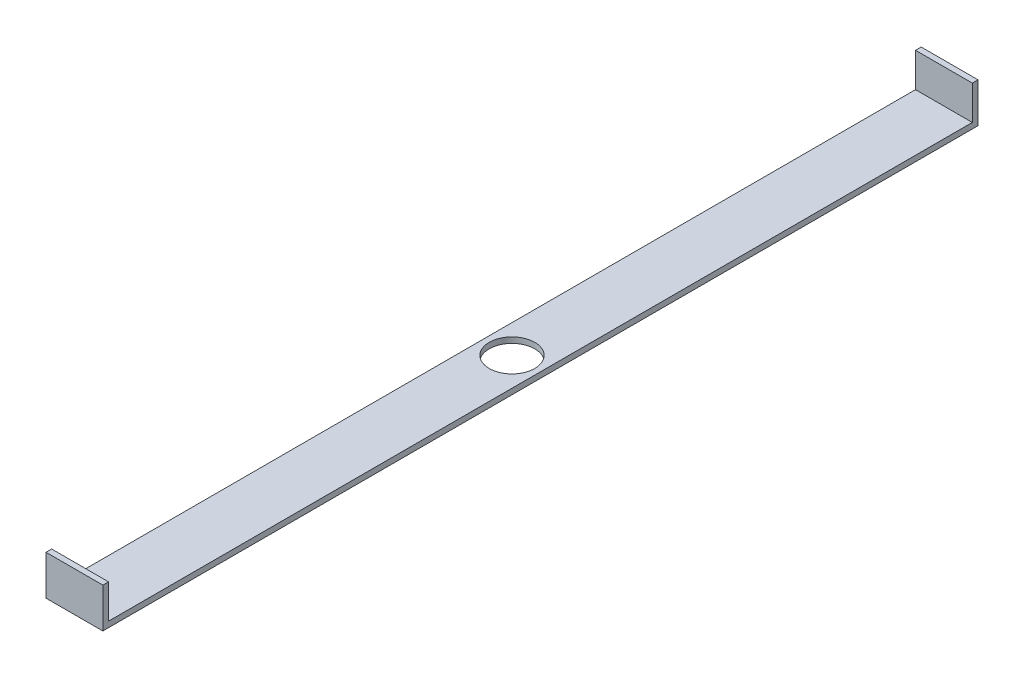
ISO-10303-21;
HEADER;
FILE_DESCRIPTION(('STEP AP214'),'2;1');
FILE_NAME('part.step','',(''),(''),'','','');
FILE_SCHEMA(('AUTOMOTIVE_DESIGN { 1 0 10303 214 1 1 1 1 }'));
ENDSEC;
DATA;
#1=APPLICATION_CONTEXT('core data for automotive mechanical design processes');
#2=APPLICATION_PROTOCOL_DEFINITION('international standard','automotive_design',2000,#1);
#3=PRODUCT_CONTEXT('',#1,'mechanical');
#4=PRODUCT('Part','Part','',(#3));
#5=PRODUCT_RELATED_PRODUCT_CATEGORY('part','',(#4));
#6=PRODUCT_DEFINITION_FORMATION('','',#4);
#7=PRODUCT_DEFINITION_CONTEXT('part definition',#1,'design');
#8=PRODUCT_DEFINITION('design','',#6,#7);
#9=PRODUCT_DEFINITION_SHAPE('','',#8);
#10=(LENGTH_UNIT() NAMED_UNIT(*) SI_UNIT(.MILLI.,.METRE.));
#11=(NAMED_UNIT(*) PLANE_ANGLE_UNIT() SI_UNIT($,.RADIAN.));
#12=(NAMED_UNIT(*) SI_UNIT($,.STERADIAN.) SOLID_ANGLE_UNIT());
#13=UNCERTAINTY_MEASURE_WITH_UNIT(LENGTH_MEASURE(1.E-05),#10,'distance_accuracy_value','');
#14=(GEOMETRIC_REPRESENTATION_CONTEXT(3) GLOBAL_UNCERTAINTY_ASSIGNED_CONTEXT((#13)) GLOBAL_UNIT_ASSIGNED_CONTEXT((#10,
#11,#12)) REPRESENTATION_CONTEXT('',''));
#15=CARTESIAN_POINT('',(0.,0.,0.));
#16=DIRECTION('',(0.,0.,1.));
#17=DIRECTION('',(1.,0.,0.));
#18=AXIS2_PLACEMENT_3D('',#15,#16,#17);
#19=CARTESIAN_POINT('',(0.,0.,770.));
#20=DIRECTION('',(0.,-1.,0.));
#21=DIRECTION('',(0.,0.,-1.));
#22=AXIS2_PLACEMENT_3D('',#19,#20,#21);
#23=PLANE('',#22);
#24=CARTESIAN_POINT('',(25.,0.,385.));
#25=DIRECTION('',(0.,1.,0.));
#26=DIRECTION('',(0.,0.,1.));
#27=AXIS2_PLACEMENT_3D('',#24,#25,#26);
#28=CIRCLE('',#27,20.);
#29=CARTESIAN_POINT('',(25.,0.,405.));
#30=VERTEX_POINT('',#29);
#31=EDGE_CURVE('E201',#30,#30,#28,.T.);
#32=ORIENTED_EDGE('',*,*,#31,.F.);
#33=EDGE_LOOP('',(#32));
#34=FACE_BOUND('',#33,.T.);
#35=DIRECTION('',(1.,0.,0.));
#36=VECTOR('',#35,1.);
#37=CARTESIAN_POINT('',(0.,0.,5.));
#38=LINE('',#37,#36);
#39=CARTESIAN_POINT('',(0.,0.,5.));
#40=VERTEX_POINT('',#39);
#41=CARTESIAN_POINT('',(50.,0.,5.));
#42=VERTEX_POINT('',#41);
#43=EDGE_CURVE('E56',#40,#42,#38,.T.);
#44=ORIENTED_EDGE('',*,*,#43,.F.);
#45=DIRECTION('',(0.,0.,-1.));
#46=VECTOR('',#45,1.);
#47=CARTESIAN_POINT('',(0.,0.,770.));
#48=LINE('',#47,#46);
#49=CARTESIAN_POINT('',(0.,0.,765.));
#50=VERTEX_POINT('',#49);
#51=EDGE_CURVE('E128',#50,#40,#48,.T.);
#52=ORIENTED_EDGE('',*,*,#51,.F.);
#53=DIRECTION('',(-1.,0.,0.));
#54=VECTOR('',#53,1.);
#55=CARTESIAN_POINT('',(0.,0.,765.));
#56=LINE('',#55,#54);
#57=CARTESIAN_POINT('',(50.,0.,765.));
#58=VERTEX_POINT('',#57);
#59=EDGE_CURVE('E130',#58,#50,#56,.T.);
#60=ORIENTED_EDGE('',*,*,#59,.F.);
#61=DIRECTION('',(0.,0.,-1.));
#62=VECTOR('',#61,1.);
#63=CARTESIAN_POINT('',(50.,0.,770.));
#64=LINE('',#63,#62);
#65=EDGE_CURVE('E61',#58,#42,#64,.T.);
#66=ORIENTED_EDGE('',*,*,#65,.T.);
#67=EDGE_LOOP('',(#44,#52,#60,#66));
#68=FACE_BOUND('',#67,.T.);
#69=ADVANCED_FACE('F39',(#34,#68),#23,.F.);
#70=CARTESIAN_POINT('',(0.,0.,770.));
#71=DIRECTION('',(1.,0.,0.));
#72=DIRECTION('',(0.,1.,0.));
#73=AXIS2_PLACEMENT_3D('',#70,#71,#72);
#74=PLANE('',#73);
#75=DIRECTION('',(0.,-1.,0.));
#76=VECTOR('',#75,1.);
#77=CARTESIAN_POINT('',(0.,0.,0.));
#78=LINE('',#77,#76);
#79=CARTESIAN_POINT('',(0.,30.,0.));
#80=VERTEX_POINT('',#79);
#81=CARTESIAN_POINT('',(0.,-5.,0.));
#82=VERTEX_POINT('',#81);
#83=EDGE_CURVE('E160',#80,#82,#78,.T.);
#84=ORIENTED_EDGE('',*,*,#83,.T.);
#85=DIRECTION('',(0.,0.,-1.));
#86=VECTOR('',#85,1.);
#87=CARTESIAN_POINT('',(0.,-5.,770.));
#88=LINE('',#87,#86);
#89=CARTESIAN_POINT('',(0.,-5.,770.));
#90=VERTEX_POINT('',#89);
#91=EDGE_CURVE('E11',#90,#82,#88,.T.);
#92=ORIENTED_EDGE('',*,*,#91,.F.);
#93=DIRECTION('',(0.,-1.,0.));
#94=VECTOR('',#93,1.);
#95=CARTESIAN_POINT('',(0.,0.,770.));
#96=LINE('',#95,#94);
#97=CARTESIAN_POINT('',(0.,30.,770.));
#98=VERTEX_POINT('',#97);
#99=EDGE_CURVE('E161',#98,#90,#96,.T.);
#100=ORIENTED_EDGE('',*,*,#99,.F.);
#101=DIRECTION('',(0.,0.,1.));
#102=VECTOR('',#101,1.);
#103=CARTESIAN_POINT('',(0.,30.,770.));
#104=LINE('',#103,#102);
#105=CARTESIAN_POINT('',(0.,30.,765.));
#106=VERTEX_POINT('',#105);
#107=EDGE_CURVE('E135',#106,#98,#104,.T.);
#108=ORIENTED_EDGE('',*,*,#107,.F.);
#109=DIRECTION('',(0.,-1.,0.));
#110=VECTOR('',#109,1.);
#111=CARTESIAN_POINT('',(0.,30.,765.));
#112=LINE('',#111,#110);
#113=EDGE_CURVE('E152',#106,#50,#112,.T.);
#114=ORIENTED_EDGE('',*,*,#113,.T.);
#115=ORIENTED_EDGE('',*,*,#51,.T.);
#116=DIRECTION('',(0.,-1.,0.));
#117=VECTOR('',#116,1.);
#118=CARTESIAN_POINT('',(0.,30.,5.));
#119=LINE('',#118,#117);
#120=CARTESIAN_POINT('',(0.,30.,5.));
#121=VERTEX_POINT('',#120);
#122=EDGE_CURVE('E108',#121,#40,#119,.T.);
#123=ORIENTED_EDGE('',*,*,#122,.F.);
#124=DIRECTION('',(0.,0.,1.));
#125=VECTOR('',#124,1.);
#126=CARTESIAN_POINT('',(0.,30.,0.));
#127=LINE('',#126,#125);
#128=EDGE_CURVE('E116',#80,#121,#127,.T.);
#129=ORIENTED_EDGE('',*,*,#128,.F.);
#130=EDGE_LOOP('',(#84,#92,#100,#108,#114,#115,#123,#129));
#131=FACE_BOUND('',#130,.T.);
#132=ADVANCED_FACE('F41',(#131),#74,.F.);
#133=CARTESIAN_POINT('',(0.,-5.,770.));
#134=DIRECTION('',(0.,1.,0.));
#135=DIRECTION('',(0.,0.,1.));
#136=AXIS2_PLACEMENT_3D('',#133,#134,#135);
#137=PLANE('',#136);
#138=CARTESIAN_POINT('',(25.,-5.,385.));
#139=DIRECTION('',(0.,1.,0.));
#140=DIRECTION('',(0.,0.,1.));
#141=AXIS2_PLACEMENT_3D('',#138,#139,#140);
#142=CIRCLE('',#141,20.);
#143=CARTESIAN_POINT('',(25.,-5.,405.));
#144=VERTEX_POINT('',#143);
#145=EDGE_CURVE('E43',#144,#144,#142,.T.);
#146=ORIENTED_EDGE('',*,*,#145,.T.);
#147=EDGE_LOOP('',(#146));
#148=FACE_BOUND('',#147,.T.);
#149=DIRECTION('',(1.,0.,0.));
#150=VECTOR('',#149,1.);
#151=CARTESIAN_POINT('',(0.,-5.,0.));
#152=LINE('',#151,#150);
#153=CARTESIAN_POINT('',(50.,-5.,0.));
#154=VERTEX_POINT('',#153);
#155=EDGE_CURVE('E174',#82,#154,#152,.T.);
#156=ORIENTED_EDGE('',*,*,#155,.T.);
#157=DIRECTION('',(0.,0.,-1.));
#158=VECTOR('',#157,1.);
#159=CARTESIAN_POINT('',(50.,-5.,770.));
#160=LINE('',#159,#158);
#161=CARTESIAN_POINT('',(50.,-5.,770.));
#162=VERTEX_POINT('',#161);
#163=EDGE_CURVE('E49',#162,#154,#160,.T.);
#164=ORIENTED_EDGE('',*,*,#163,.F.);
#165=DIRECTION('',(1.,0.,0.));
#166=VECTOR('',#165,1.);
#167=CARTESIAN_POINT('',(0.,-5.,770.));
#168=LINE('',#167,#166);
#169=EDGE_CURVE('E165',#90,#162,#168,.T.);
#170=ORIENTED_EDGE('',*,*,#169,.F.);
#171=ORIENTED_EDGE('',*,*,#91,.T.);
#172=EDGE_LOOP('',(#156,#164,#170,#171));
#173=FACE_BOUND('',#172,.T.);
#174=ADVANCED_FACE('F217',(#148,#173),#137,.F.);
#175=CARTESIAN_POINT('',(50.,0.,770.));
#176=DIRECTION('',(-1.,0.,0.));
#177=DIRECTION('',(0.,0.,1.));
#178=AXIS2_PLACEMENT_3D('',#175,#176,#177);
#179=PLANE('',#178);
#180=DIRECTION('',(0.,1.,0.));
#181=VECTOR('',#180,1.);
#182=CARTESIAN_POINT('',(50.,0.,0.));
#183=LINE('',#182,#181);
#184=CARTESIAN_POINT('',(50.,30.,0.));
#185=VERTEX_POINT('',#184);
#186=EDGE_CURVE('E166',#154,#185,#183,.T.);
#187=ORIENTED_EDGE('',*,*,#186,.T.);
#188=DIRECTION('',(0.,0.,-1.));
#189=VECTOR('',#188,1.);
#190=CARTESIAN_POINT('',(50.,30.,0.));
#191=LINE('',#190,#189);
#192=CARTESIAN_POINT('',(50.,30.,5.));
#193=VERTEX_POINT('',#192);
#194=EDGE_CURVE('E115',#193,#185,#191,.T.);
#195=ORIENTED_EDGE('',*,*,#194,.F.);
#196=DIRECTION('',(0.,-1.,0.));
#197=VECTOR('',#196,1.);
#198=CARTESIAN_POINT('',(50.,30.,5.));
#199=LINE('',#198,#197);
#200=EDGE_CURVE('E110',#193,#42,#199,.T.);
#201=ORIENTED_EDGE('',*,*,#200,.T.);
#202=ORIENTED_EDGE('',*,*,#65,.F.);
#203=DIRECTION('',(0.,-1.,0.));
#204=VECTOR('',#203,1.);
#205=CARTESIAN_POINT('',(50.,30.,765.));
#206=LINE('',#205,#204);
#207=CARTESIAN_POINT('',(50.,30.,765.));
#208=VERTEX_POINT('',#207);
#209=EDGE_CURVE('E156',#208,#58,#206,.T.);
#210=ORIENTED_EDGE('',*,*,#209,.F.);
#211=DIRECTION('',(0.,0.,-1.));
#212=VECTOR('',#211,1.);
#213=CARTESIAN_POINT('',(50.,30.,770.));
#214=LINE('',#213,#212);
#215=CARTESIAN_POINT('',(50.,30.,770.));
#216=VERTEX_POINT('',#215);
#217=EDGE_CURVE('E147',#216,#208,#214,.T.);
#218=ORIENTED_EDGE('',*,*,#217,.F.);
#219=DIRECTION('',(0.,1.,0.));
#220=VECTOR('',#219,1.);
#221=CARTESIAN_POINT('',(50.,0.,770.));
#222=LINE('',#221,#220);
#223=EDGE_CURVE('E169',#162,#216,#222,.T.);
#224=ORIENTED_EDGE('',*,*,#223,.F.);
#225=ORIENTED_EDGE('',*,*,#163,.T.);
#226=EDGE_LOOP('',(#187,#195,#201,#202,#210,#218,#224,#225));
#227=FACE_BOUND('',#226,.T.);
#228=ADVANCED_FACE('F189',(#227),#179,.F.);
#229=CARTESIAN_POINT('',(0.,0.,770.));
#230=DIRECTION('',(0.,0.,1.));
#231=DIRECTION('',(1.,0.,0.));
#232=AXIS2_PLACEMENT_3D('',#229,#230,#231);
#233=PLANE('',#232);
#234=ORIENTED_EDGE('',*,*,#99,.T.);
#235=ORIENTED_EDGE('',*,*,#169,.T.);
#236=ORIENTED_EDGE('',*,*,#223,.T.);
#237=DIRECTION('',(1.,0.,0.));
#238=VECTOR('',#237,1.);
#239=CARTESIAN_POINT('',(0.,30.,770.));
#240=LINE('',#239,#238);
#241=EDGE_CURVE('E143',#98,#216,#240,.T.);
#242=ORIENTED_EDGE('',*,*,#241,.F.);
#243=EDGE_LOOP('',(#234,#235,#236,#242));
#244=FACE_BOUND('',#243,.T.);
#245=ADVANCED_FACE('F222',(#244),#233,.T.);
#246=CARTESIAN_POINT('',(0.,0.,0.));
#247=DIRECTION('',(0.,0.,1.));
#248=DIRECTION('',(1.,0.,0.));
#249=AXIS2_PLACEMENT_3D('',#246,#247,#248);
#250=PLANE('',#249);
#251=ORIENTED_EDGE('',*,*,#83,.F.);
#252=DIRECTION('',(-1.,0.,0.));
#253=VECTOR('',#252,1.);
#254=CARTESIAN_POINT('',(0.,30.,0.));
#255=LINE('',#254,#253);
#256=EDGE_CURVE('E122',#185,#80,#255,.T.);
#257=ORIENTED_EDGE('',*,*,#256,.F.);
#258=ORIENTED_EDGE('',*,*,#186,.F.);
#259=ORIENTED_EDGE('',*,*,#155,.F.);
#260=EDGE_LOOP('',(#251,#257,#258,#259));
#261=FACE_BOUND('',#260,.T.);
#262=ADVANCED_FACE('F193',(#261),#250,.F.);
#263=CARTESIAN_POINT('',(0.,30.,765.));
#264=DIRECTION('',(0.,0.,1.));
#265=DIRECTION('',(1.,0.,0.));
#266=AXIS2_PLACEMENT_3D('',#263,#264,#265);
#267=PLANE('',#266);
#268=ORIENTED_EDGE('',*,*,#59,.T.);
#269=ORIENTED_EDGE('',*,*,#113,.F.);
#270=DIRECTION('',(-1.,0.,0.));
#271=VECTOR('',#270,1.);
#272=CARTESIAN_POINT('',(0.,30.,765.));
#273=LINE('',#272,#271);
#274=EDGE_CURVE('E150',#208,#106,#273,.T.);
#275=ORIENTED_EDGE('',*,*,#274,.F.);
#276=ORIENTED_EDGE('',*,*,#209,.T.);
#277=EDGE_LOOP('',(#268,#269,#275,#276));
#278=FACE_BOUND('',#277,.T.);
#279=ADVANCED_FACE('F236',(#278),#267,.F.);
#280=CARTESIAN_POINT('',(0.,30.,0.));
#281=DIRECTION('',(0.,-1.,0.));
#282=DIRECTION('',(0.,0.,-1.));
#283=AXIS2_PLACEMENT_3D('',#280,#281,#282);
#284=PLANE('',#283);
#285=ORIENTED_EDGE('',*,*,#107,.T.);
#286=ORIENTED_EDGE('',*,*,#241,.T.);
#287=ORIENTED_EDGE('',*,*,#217,.T.);
#288=ORIENTED_EDGE('',*,*,#274,.T.);
#289=EDGE_LOOP('',(#285,#286,#287,#288));
#290=FACE_BOUND('',#289,.T.);
#291=ADVANCED_FACE('F231',(#290),#284,.F.);
#292=CARTESIAN_POINT('',(0.,30.,5.));
#293=DIRECTION('',(0.,0.,-1.));
#294=DIRECTION('',(-1.,0.,0.));
#295=AXIS2_PLACEMENT_3D('',#292,#293,#294);
#296=PLANE('',#295);
#297=ORIENTED_EDGE('',*,*,#43,.T.);
#298=ORIENTED_EDGE('',*,*,#200,.F.);
#299=DIRECTION('',(1.,0.,0.));
#300=VECTOR('',#299,1.);
#301=CARTESIAN_POINT('',(0.,30.,5.));
#302=LINE('',#301,#300);
#303=EDGE_CURVE('E104',#121,#193,#302,.T.);
#304=ORIENTED_EDGE('',*,*,#303,.F.);
#305=ORIENTED_EDGE('',*,*,#122,.T.);
#306=EDGE_LOOP('',(#297,#298,#304,#305));
#307=FACE_BOUND('',#306,.T.);
#308=ADVANCED_FACE('F106',(#307),#296,.F.);
#309=CARTESIAN_POINT('',(0.,30.,0.));
#310=DIRECTION('',(0.,1.,0.));
#311=DIRECTION('',(0.,0.,1.));
#312=AXIS2_PLACEMENT_3D('',#309,#310,#311);
#313=PLANE('',#312);
#314=ORIENTED_EDGE('',*,*,#128,.T.);
#315=ORIENTED_EDGE('',*,*,#303,.T.);
#316=ORIENTED_EDGE('',*,*,#194,.T.);
#317=ORIENTED_EDGE('',*,*,#256,.T.);
#318=EDGE_LOOP('',(#314,#315,#316,#317));
#319=FACE_BOUND('',#318,.T.);
#320=ADVANCED_FACE('F120',(#319),#313,.T.);
#321=CARTESIAN_POINT('',(25.,-30.,385.));
#322=DIRECTION('',(0.,1.,0.));
#323=DIRECTION('',(0.,0.,1.));
#324=AXIS2_PLACEMENT_3D('',#321,#322,#323);
#325=CYLINDRICAL_SURFACE('',#324,20.);
#326=ORIENTED_EDGE('',*,*,#31,.T.);
#327=EDGE_LOOP('',(#326));
#328=FACE_BOUND('',#327,.T.);
#329=ORIENTED_EDGE('',*,*,#145,.F.);
#330=EDGE_LOOP('',(#329));
#331=FACE_BOUND('',#330,.T.);
#332=ADVANCED_FACE('F209',(#328,#331),#325,.F.);
#333=CLOSED_SHELL('',(#69,#132,#174,#228,#245,#262,#279,#291,#308,#320,#332));
#334=MANIFOLD_SOLID_BREP('B2',#333);
#335=ADVANCED_BREP_SHAPE_REPRESENTATION('',(#18,#334),#14);
#336=SHAPE_DEFINITION_REPRESENTATION(#9,#335);
ENDSEC;
END-ISO-10303-21;
